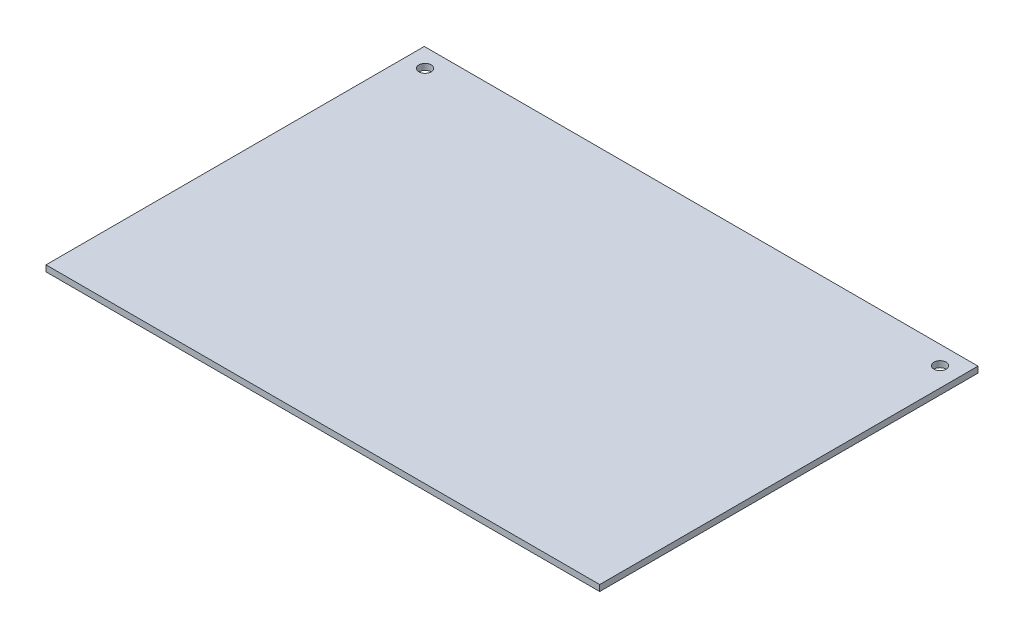
ISO-10303-21;
HEADER;
FILE_DESCRIPTION(('STEP AP214'),'2;1');
FILE_NAME('part.step','',(''),(''),'','','');
FILE_SCHEMA(('AUTOMOTIVE_DESIGN { 1 0 10303 214 1 1 1 1 }'));
ENDSEC;
DATA;
#1=APPLICATION_CONTEXT('core data for automotive mechanical design processes');
#2=APPLICATION_PROTOCOL_DEFINITION('international standard','automotive_design',2000,#1);
#3=PRODUCT_CONTEXT('',#1,'mechanical');
#4=PRODUCT('Part','Part','',(#3));
#5=PRODUCT_RELATED_PRODUCT_CATEGORY('part','',(#4));
#6=PRODUCT_DEFINITION_FORMATION('','',#4);
#7=PRODUCT_DEFINITION_CONTEXT('part definition',#1,'design');
#8=PRODUCT_DEFINITION('design','',#6,#7);
#9=PRODUCT_DEFINITION_SHAPE('','',#8);
#10=(LENGTH_UNIT() NAMED_UNIT(*) SI_UNIT(.MILLI.,.METRE.));
#11=(NAMED_UNIT(*) PLANE_ANGLE_UNIT() SI_UNIT($,.RADIAN.));
#12=(NAMED_UNIT(*) SI_UNIT($,.STERADIAN.) SOLID_ANGLE_UNIT());
#13=UNCERTAINTY_MEASURE_WITH_UNIT(LENGTH_MEASURE(1.E-05),#10,'distance_accuracy_value','');
#14=(GEOMETRIC_REPRESENTATION_CONTEXT(3) GLOBAL_UNCERTAINTY_ASSIGNED_CONTEXT((#13)) GLOBAL_UNIT_ASSIGNED_CONTEXT((#10,
#11,#12)) REPRESENTATION_CONTEXT('',''));
#15=CARTESIAN_POINT('',(0.,0.,0.));
#16=DIRECTION('',(0.,0.,1.));
#17=DIRECTION('',(1.,0.,0.));
#18=AXIS2_PLACEMENT_3D('',#15,#16,#17);
#19=CARTESIAN_POINT('',(90.75,2.,62.));
#20=DIRECTION('',(-1.,0.,0.));
#21=DIRECTION('',(0.,0.,1.));
#22=AXIS2_PLACEMENT_3D('',#19,#20,#21);
#23=PLANE('',#22);
#24=DIRECTION('',(0.,0.,-1.));
#25=VECTOR('',#24,1.);
#26=CARTESIAN_POINT('',(90.75,0.,62.));
#27=LINE('',#26,#25);
#28=CARTESIAN_POINT('',(90.75,0.,62.));
#29=VERTEX_POINT('',#28);
#30=CARTESIAN_POINT('',(90.75,0.,-62.));
#31=VERTEX_POINT('',#30);
#32=EDGE_CURVE('E99',#29,#31,#27,.T.);
#33=ORIENTED_EDGE('',*,*,#32,.T.);
#34=DIRECTION('',(0.,-1.,0.));
#35=VECTOR('',#34,1.);
#36=CARTESIAN_POINT('',(90.75,2.,-62.));
#37=LINE('',#36,#35);
#38=CARTESIAN_POINT('',(90.75,2.,-62.));
#39=VERTEX_POINT('',#38);
#40=EDGE_CURVE('E11',#39,#31,#37,.T.);
#41=ORIENTED_EDGE('',*,*,#40,.F.);
#42=DIRECTION('',(0.,0.,-1.));
#43=VECTOR('',#42,1.);
#44=CARTESIAN_POINT('',(90.75,2.,62.));
#45=LINE('',#44,#43);
#46=CARTESIAN_POINT('',(90.75,2.,62.));
#47=VERTEX_POINT('',#46);
#48=EDGE_CURVE('E87',#47,#39,#45,.T.);
#49=ORIENTED_EDGE('',*,*,#48,.F.);
#50=DIRECTION('',(0.,-1.,0.));
#51=VECTOR('',#50,1.);
#52=CARTESIAN_POINT('',(90.75,2.,62.));
#53=LINE('',#52,#51);
#54=EDGE_CURVE('E95',#47,#29,#53,.T.);
#55=ORIENTED_EDGE('',*,*,#54,.T.);
#56=EDGE_LOOP('',(#33,#41,#49,#55));
#57=FACE_BOUND('',#56,.T.);
#58=ADVANCED_FACE('F36',(#57),#23,.F.);
#59=CARTESIAN_POINT('',(-90.75,2.,-62.));
#60=DIRECTION('',(0.,0.,1.));
#61=DIRECTION('',(1.,0.,0.));
#62=AXIS2_PLACEMENT_3D('',#59,#60,#61);
#63=PLANE('',#62);
#64=DIRECTION('',(-1.,0.,0.));
#65=VECTOR('',#64,1.);
#66=CARTESIAN_POINT('',(-90.75,0.,-62.));
#67=LINE('',#66,#65);
#68=CARTESIAN_POINT('',(-90.75,0.,-62.));
#69=VERTEX_POINT('',#68);
#70=EDGE_CURVE('E91',#31,#69,#67,.T.);
#71=ORIENTED_EDGE('',*,*,#70,.T.);
#72=DIRECTION('',(0.,-1.,0.));
#73=VECTOR('',#72,1.);
#74=CARTESIAN_POINT('',(-90.75,2.,-62.));
#75=LINE('',#74,#73);
#76=CARTESIAN_POINT('',(-90.75,2.,-62.));
#77=VERTEX_POINT('',#76);
#78=EDGE_CURVE('E44',#77,#69,#75,.T.);
#79=ORIENTED_EDGE('',*,*,#78,.F.);
#80=DIRECTION('',(-1.,0.,0.));
#81=VECTOR('',#80,1.);
#82=CARTESIAN_POINT('',(-90.75,2.,-62.));
#83=LINE('',#82,#81);
#84=EDGE_CURVE('E82',#39,#77,#83,.T.);
#85=ORIENTED_EDGE('',*,*,#84,.F.);
#86=ORIENTED_EDGE('',*,*,#40,.T.);
#87=EDGE_LOOP('',(#71,#79,#85,#86));
#88=FACE_BOUND('',#87,.T.);
#89=ADVANCED_FACE('F90',(#88),#63,.F.);
#90=CARTESIAN_POINT('',(-90.75,2.,62.));
#91=DIRECTION('',(1.,0.,0.));
#92=DIRECTION('',(0.,0.,-1.));
#93=AXIS2_PLACEMENT_3D('',#90,#91,#92);
#94=PLANE('',#93);
#95=DIRECTION('',(0.,0.,1.));
#96=VECTOR('',#95,1.);
#97=CARTESIAN_POINT('',(-90.75,0.,62.));
#98=LINE('',#97,#96);
#99=CARTESIAN_POINT('',(-90.75,0.,62.));
#100=VERTEX_POINT('',#99);
#101=EDGE_CURVE('E69',#69,#100,#98,.T.);
#102=ORIENTED_EDGE('',*,*,#101,.T.);
#103=DIRECTION('',(0.,-1.,0.));
#104=VECTOR('',#103,1.);
#105=CARTESIAN_POINT('',(-90.75,2.,62.));
#106=LINE('',#105,#104);
#107=CARTESIAN_POINT('',(-90.75,2.,62.));
#108=VERTEX_POINT('',#107);
#109=EDGE_CURVE('E92',#108,#100,#106,.T.);
#110=ORIENTED_EDGE('',*,*,#109,.F.);
#111=DIRECTION('',(0.,0.,1.));
#112=VECTOR('',#111,1.);
#113=CARTESIAN_POINT('',(-90.75,2.,62.));
#114=LINE('',#113,#112);
#115=EDGE_CURVE('E85',#77,#108,#114,.T.);
#116=ORIENTED_EDGE('',*,*,#115,.F.);
#117=ORIENTED_EDGE('',*,*,#78,.T.);
#118=EDGE_LOOP('',(#102,#110,#116,#117));
#119=FACE_BOUND('',#118,.T.);
#120=ADVANCED_FACE('F93',(#119),#94,.F.);
#121=CARTESIAN_POINT('',(-90.75,2.,62.));
#122=DIRECTION('',(0.,0.,-1.));
#123=DIRECTION('',(-1.,0.,0.));
#124=AXIS2_PLACEMENT_3D('',#121,#122,#123);
#125=PLANE('',#124);
#126=DIRECTION('',(1.,0.,0.));
#127=VECTOR('',#126,1.);
#128=CARTESIAN_POINT('',(-90.75,0.,62.));
#129=LINE('',#128,#127);
#130=EDGE_CURVE('E75',#100,#29,#129,.T.);
#131=ORIENTED_EDGE('',*,*,#130,.T.);
#132=ORIENTED_EDGE('',*,*,#54,.F.);
#133=DIRECTION('',(1.,0.,0.));
#134=VECTOR('',#133,1.);
#135=CARTESIAN_POINT('',(-90.75,2.,62.));
#136=LINE('',#135,#134);
#137=EDGE_CURVE('E52',#108,#47,#136,.T.);
#138=ORIENTED_EDGE('',*,*,#137,.F.);
#139=ORIENTED_EDGE('',*,*,#109,.T.);
#140=EDGE_LOOP('',(#131,#132,#138,#139));
#141=FACE_BOUND('',#140,.T.);
#142=ADVANCED_FACE('F107',(#141),#125,.F.);
#143=CARTESIAN_POINT('',(0.,2.,0.));
#144=DIRECTION('',(0.,-1.,0.));
#145=DIRECTION('',(0.,0.,-1.));
#146=AXIS2_PLACEMENT_3D('',#143,#144,#145);
#147=PLANE('',#146);
#148=CARTESIAN_POINT('',(-84.400671124517,2.,-55.9051187912865));
#149=DIRECTION('',(0.,1.,0.));
#150=DIRECTION('',(0.,0.,1.));
#151=AXIS2_PLACEMENT_3D('',#148,#149,#150);
#152=CIRCLE('',#151,2.);
#153=CARTESIAN_POINT('',(-84.400671124517,2.,-53.9051187912865));
#154=VERTEX_POINT('',#153);
#155=EDGE_CURVE('E119',#154,#154,#152,.T.);
#156=ORIENTED_EDGE('',*,*,#155,.F.);
#157=EDGE_LOOP('',(#156));
#158=FACE_BOUND('',#157,.T.);
#159=CARTESIAN_POINT('',(84.400671124517,2.,-55.9051187912865));
#160=DIRECTION('',(0.,1.,0.));
#161=DIRECTION('',(0.,0.,1.));
#162=AXIS2_PLACEMENT_3D('',#159,#160,#161);
#163=CIRCLE('',#162,2.);
#164=CARTESIAN_POINT('',(84.400671124517,2.,-53.9051187912865));
#165=VERTEX_POINT('',#164);
#166=EDGE_CURVE('E116',#165,#165,#163,.T.);
#167=ORIENTED_EDGE('',*,*,#166,.F.);
#168=EDGE_LOOP('',(#167));
#169=FACE_BOUND('',#168,.T.);
#170=ORIENTED_EDGE('',*,*,#48,.T.);
#171=ORIENTED_EDGE('',*,*,#84,.T.);
#172=ORIENTED_EDGE('',*,*,#115,.T.);
#173=ORIENTED_EDGE('',*,*,#137,.T.);
#174=EDGE_LOOP('',(#170,#171,#172,#173));
#175=FACE_BOUND('',#174,.T.);
#176=ADVANCED_FACE('F83',(#158,#169,#175),#147,.F.);
#177=CARTESIAN_POINT('',(0.,0.,0.));
#178=DIRECTION('',(0.,-1.,0.));
#179=DIRECTION('',(0.,0.,-1.));
#180=AXIS2_PLACEMENT_3D('',#177,#178,#179);
#181=PLANE('',#180);
#182=CARTESIAN_POINT('',(-84.400671124517,0.,-55.9051187912865));
#183=DIRECTION('',(0.,1.,0.));
#184=DIRECTION('',(0.,0.,1.));
#185=AXIS2_PLACEMENT_3D('',#182,#183,#184);
#186=CIRCLE('',#185,2.);
#187=CARTESIAN_POINT('',(-84.400671124517,0.,-53.9051187912865));
#188=VERTEX_POINT('',#187);
#189=EDGE_CURVE('E102',#188,#188,#186,.T.);
#190=ORIENTED_EDGE('',*,*,#189,.T.);
#191=EDGE_LOOP('',(#190));
#192=FACE_BOUND('',#191,.T.);
#193=CARTESIAN_POINT('',(84.400671124517,0.,-55.9051187912865));
#194=DIRECTION('',(0.,1.,0.));
#195=DIRECTION('',(0.,0.,1.));
#196=AXIS2_PLACEMENT_3D('',#193,#194,#195);
#197=CIRCLE('',#196,2.);
#198=CARTESIAN_POINT('',(84.400671124517,0.,-53.9051187912865));
#199=VERTEX_POINT('',#198);
#200=EDGE_CURVE('E113',#199,#199,#197,.T.);
#201=ORIENTED_EDGE('',*,*,#200,.T.);
#202=EDGE_LOOP('',(#201));
#203=FACE_BOUND('',#202,.T.);
#204=ORIENTED_EDGE('',*,*,#32,.F.);
#205=ORIENTED_EDGE('',*,*,#130,.F.);
#206=ORIENTED_EDGE('',*,*,#101,.F.);
#207=ORIENTED_EDGE('',*,*,#70,.F.);
#208=EDGE_LOOP('',(#204,#205,#206,#207));
#209=FACE_BOUND('',#208,.T.);
#210=ADVANCED_FACE('F110',(#192,#203,#209),#181,.T.);
#211=CARTESIAN_POINT('',(84.400671124517,0.,-55.9051187912865));
#212=DIRECTION('',(0.,1.,0.));
#213=DIRECTION('',(0.,0.,1.));
#214=AXIS2_PLACEMENT_3D('',#211,#212,#213);
#215=CYLINDRICAL_SURFACE('',#214,2.);
#216=ORIENTED_EDGE('',*,*,#200,.F.);
#217=EDGE_LOOP('',(#216));
#218=FACE_BOUND('',#217,.T.);
#219=ORIENTED_EDGE('',*,*,#166,.T.);
#220=EDGE_LOOP('',(#219));
#221=FACE_BOUND('',#220,.T.);
#222=ADVANCED_FACE('F130',(#218,#221),#215,.F.);
#223=CARTESIAN_POINT('',(-84.400671124517,0.,-55.9051187912865));
#224=DIRECTION('',(0.,1.,0.));
#225=DIRECTION('',(0.,0.,1.));
#226=AXIS2_PLACEMENT_3D('',#223,#224,#225);
#227=CYLINDRICAL_SURFACE('',#226,2.);
#228=ORIENTED_EDGE('',*,*,#189,.F.);
#229=EDGE_LOOP('',(#228));
#230=FACE_BOUND('',#229,.T.);
#231=ORIENTED_EDGE('',*,*,#155,.T.);
#232=EDGE_LOOP('',(#231));
#233=FACE_BOUND('',#232,.T.);
#234=ADVANCED_FACE('F127',(#230,#233),#227,.F.);
#235=CLOSED_SHELL('',(#58,#89,#120,#142,#176,#210,#222,#234));
#236=MANIFOLD_SOLID_BREP('B2',#235);
#237=ADVANCED_BREP_SHAPE_REPRESENTATION('',(#18,#236),#14);
#238=SHAPE_DEFINITION_REPRESENTATION(#9,#237);
ENDSEC;
END-ISO-10303-21;
